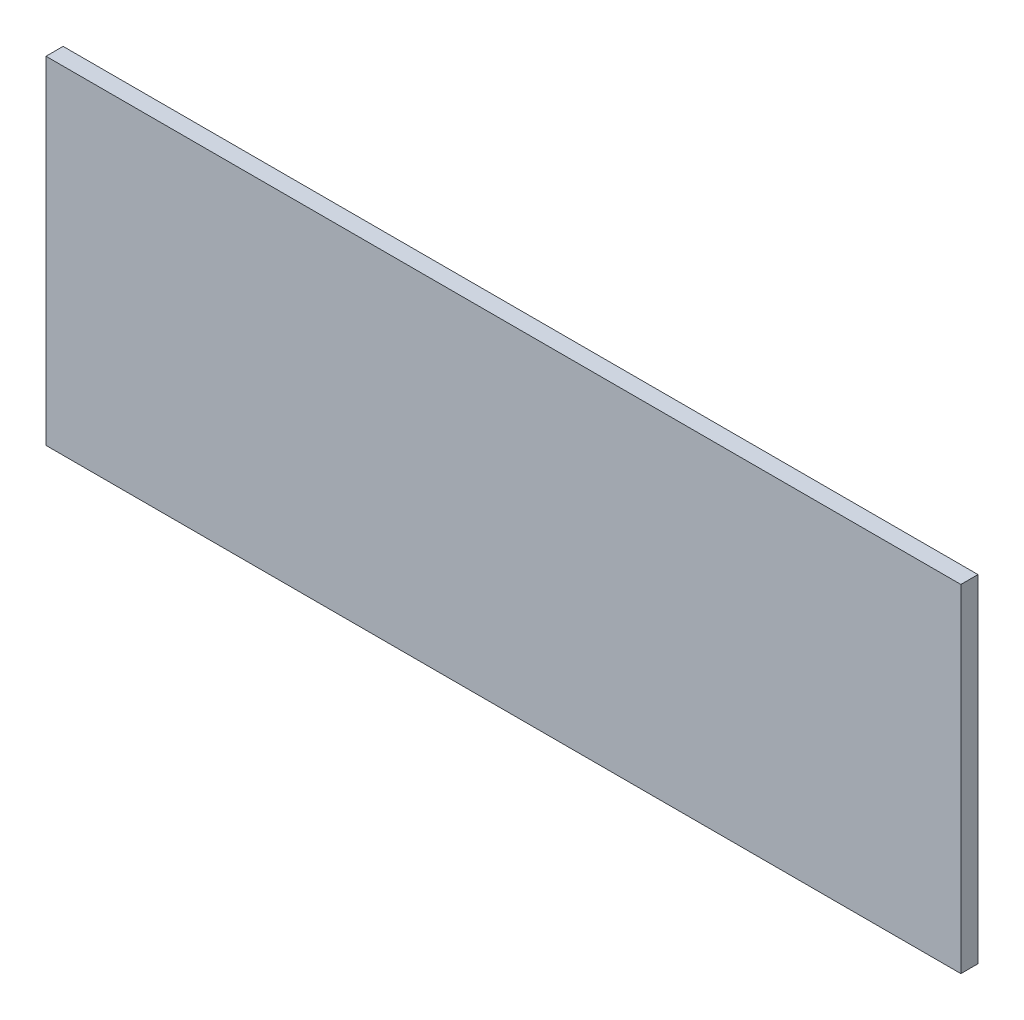
ISO-10303-21;
HEADER;
FILE_DESCRIPTION(('STEP AP214'),'2;1');
FILE_NAME('part.step','',(''),(''),'','','');
FILE_SCHEMA(('AUTOMOTIVE_DESIGN { 1 0 10303 214 1 1 1 1 }'));
ENDSEC;
DATA;
#1=APPLICATION_CONTEXT('core data for automotive mechanical design processes');
#2=APPLICATION_PROTOCOL_DEFINITION('international standard','automotive_design',2000,#1);
#3=PRODUCT_CONTEXT('',#1,'mechanical');
#4=PRODUCT('Part','Part','',(#3));
#5=PRODUCT_RELATED_PRODUCT_CATEGORY('part','',(#4));
#6=PRODUCT_DEFINITION_FORMATION('','',#4);
#7=PRODUCT_DEFINITION_CONTEXT('part definition',#1,'design');
#8=PRODUCT_DEFINITION('design','',#6,#7);
#9=PRODUCT_DEFINITION_SHAPE('','',#8);
#10=(LENGTH_UNIT() NAMED_UNIT(*) SI_UNIT(.MILLI.,.METRE.));
#11=(NAMED_UNIT(*) PLANE_ANGLE_UNIT() SI_UNIT($,.RADIAN.));
#12=(NAMED_UNIT(*) SI_UNIT($,.STERADIAN.) SOLID_ANGLE_UNIT());
#13=UNCERTAINTY_MEASURE_WITH_UNIT(LENGTH_MEASURE(1.E-05),#10,'distance_accuracy_value','');
#14=(GEOMETRIC_REPRESENTATION_CONTEXT(3) GLOBAL_UNCERTAINTY_ASSIGNED_CONTEXT((#13)) GLOBAL_UNIT_ASSIGNED_CONTEXT((#10,
#11,#12)) REPRESENTATION_CONTEXT('',''));
#15=CARTESIAN_POINT('',(0.,0.,0.));
#16=DIRECTION('',(0.,0.,1.));
#17=DIRECTION('',(1.,0.,0.));
#18=AXIS2_PLACEMENT_3D('',#15,#16,#17);
#19=CARTESIAN_POINT('',(96.5670013427734,66.3369979858398,0.));
#20=DIRECTION('',(0.,1.,0.));
#21=DIRECTION('',(1.,0.,0.));
#22=AXIS2_PLACEMENT_3D('',#19,#20,#21);
#23=PLANE('',#22);
#24=DIRECTION('',(1.,0.,0.));
#25=VECTOR('',#24,1.);
#26=CARTESIAN_POINT('',(96.5670013427734,66.3369979858398,0.03556));
#27=LINE('',#26,#25);
#28=CARTESIAN_POINT('',(96.5670013427734,66.3369979858398,0.03556));
#29=VERTEX_POINT('',#28);
#30=CARTESIAN_POINT('',(98.4670028686523,66.3369979858398,0.03556));
#31=VERTEX_POINT('',#30);
#32=EDGE_CURVE('E11',#29,#31,#27,.T.);
#33=ORIENTED_EDGE('',*,*,#32,.F.);
#34=DIRECTION('',(0.,0.,1.));
#35=VECTOR('',#34,1.);
#36=CARTESIAN_POINT('',(96.5670013427734,66.3369979858398,0.));
#37=LINE('',#36,#35);
#38=CARTESIAN_POINT('',(96.5670013427734,66.3369979858398,0.));
#39=VERTEX_POINT('',#38);
#40=EDGE_CURVE('E24',#39,#29,#37,.T.);
#41=ORIENTED_EDGE('',*,*,#40,.F.);
#42=DIRECTION('',(1.,0.,0.));
#43=VECTOR('',#42,1.);
#44=CARTESIAN_POINT('',(96.5670013427734,66.3369979858398,0.));
#45=LINE('',#44,#43);
#46=CARTESIAN_POINT('',(98.4670028686523,66.3369979858398,0.));
#47=VERTEX_POINT('',#46);
#48=EDGE_CURVE('E75',#39,#47,#45,.T.);
#49=ORIENTED_EDGE('',*,*,#48,.T.);
#50=DIRECTION('',(0.,0.,1.));
#51=VECTOR('',#50,1.);
#52=CARTESIAN_POINT('',(98.4670028686523,66.3369979858398,0.));
#53=LINE('',#52,#51);
#54=EDGE_CURVE('E37',#47,#31,#53,.T.);
#55=ORIENTED_EDGE('',*,*,#54,.T.);
#56=EDGE_LOOP('',(#33,#41,#49,#55));
#57=FACE_BOUND('',#56,.T.);
#58=ADVANCED_FACE('F17',(#57),#23,.F.);
#59=CARTESIAN_POINT('',(98.4670028686523,66.3369979858398,0.));
#60=DIRECTION('',(-1.,0.,0.));
#61=DIRECTION('',(0.,1.,0.));
#62=AXIS2_PLACEMENT_3D('',#59,#60,#61);
#63=PLANE('',#62);
#64=DIRECTION('',(0.,1.,0.));
#65=VECTOR('',#64,1.);
#66=CARTESIAN_POINT('',(98.4670028686523,66.3369979858398,0.03556));
#67=LINE('',#66,#65);
#68=CARTESIAN_POINT('',(98.4670028686523,67.0370025634766,0.03556));
#69=VERTEX_POINT('',#68);
#70=EDGE_CURVE('E83',#31,#69,#67,.T.);
#71=ORIENTED_EDGE('',*,*,#70,.F.);
#72=ORIENTED_EDGE('',*,*,#54,.F.);
#73=DIRECTION('',(0.,1.,0.));
#74=VECTOR('',#73,1.);
#75=CARTESIAN_POINT('',(98.4670028686523,66.3369979858398,0.));
#76=LINE('',#75,#74);
#77=CARTESIAN_POINT('',(98.4670028686523,67.0370025634766,0.));
#78=VERTEX_POINT('',#77);
#79=EDGE_CURVE('E81',#47,#78,#76,.T.);
#80=ORIENTED_EDGE('',*,*,#79,.T.);
#81=DIRECTION('',(0.,0.,1.));
#82=VECTOR('',#81,1.);
#83=CARTESIAN_POINT('',(98.4670028686523,67.0370025634766,0.));
#84=LINE('',#83,#82);
#85=EDGE_CURVE('E67',#78,#69,#84,.T.);
#86=ORIENTED_EDGE('',*,*,#85,.T.);
#87=EDGE_LOOP('',(#71,#72,#80,#86));
#88=FACE_BOUND('',#87,.T.);
#89=ADVANCED_FACE('F89',(#88),#63,.F.);
#90=CARTESIAN_POINT('',(98.4670028686523,67.0370025634766,0.));
#91=DIRECTION('',(0.,-1.,0.));
#92=DIRECTION('',(-1.,0.,0.));
#93=AXIS2_PLACEMENT_3D('',#90,#91,#92);
#94=PLANE('',#93);
#95=DIRECTION('',(-1.,0.,0.));
#96=VECTOR('',#95,1.);
#97=CARTESIAN_POINT('',(98.4670028686523,67.0370025634766,0.03556));
#98=LINE('',#97,#96);
#99=CARTESIAN_POINT('',(96.5670013427734,67.0370025634766,0.03556));
#100=VERTEX_POINT('',#99);
#101=EDGE_CURVE('E71',#69,#100,#98,.T.);
#102=ORIENTED_EDGE('',*,*,#101,.F.);
#103=ORIENTED_EDGE('',*,*,#85,.F.);
#104=DIRECTION('',(-1.,0.,0.));
#105=VECTOR('',#104,1.);
#106=CARTESIAN_POINT('',(98.4670028686523,67.0370025634766,0.));
#107=LINE('',#106,#105);
#108=CARTESIAN_POINT('',(96.5670013427734,67.0370025634766,0.));
#109=VERTEX_POINT('',#108);
#110=EDGE_CURVE('E63',#78,#109,#107,.T.);
#111=ORIENTED_EDGE('',*,*,#110,.T.);
#112=DIRECTION('',(0.,0.,1.));
#113=VECTOR('',#112,1.);
#114=CARTESIAN_POINT('',(96.5670013427734,67.0370025634766,0.));
#115=LINE('',#114,#113);
#116=EDGE_CURVE('E53',#109,#100,#115,.T.);
#117=ORIENTED_EDGE('',*,*,#116,.T.);
#118=EDGE_LOOP('',(#102,#103,#111,#117));
#119=FACE_BOUND('',#118,.T.);
#120=ADVANCED_FACE('F66',(#119),#94,.F.);
#121=CARTESIAN_POINT('',(96.5670013427734,67.0370025634766,0.));
#122=DIRECTION('',(1.,0.,0.));
#123=DIRECTION('',(0.,-1.,0.));
#124=AXIS2_PLACEMENT_3D('',#121,#122,#123);
#125=PLANE('',#124);
#126=DIRECTION('',(0.,-1.,0.));
#127=VECTOR('',#126,1.);
#128=CARTESIAN_POINT('',(96.5670013427734,67.0370025634766,0.03556));
#129=LINE('',#128,#127);
#130=EDGE_CURVE('E59',#100,#29,#129,.T.);
#131=ORIENTED_EDGE('',*,*,#130,.F.);
#132=ORIENTED_EDGE('',*,*,#116,.F.);
#133=DIRECTION('',(0.,-1.,0.));
#134=VECTOR('',#133,1.);
#135=CARTESIAN_POINT('',(96.5670013427734,67.0370025634766,0.));
#136=LINE('',#135,#134);
#137=EDGE_CURVE('E57',#109,#39,#136,.T.);
#138=ORIENTED_EDGE('',*,*,#137,.T.);
#139=ORIENTED_EDGE('',*,*,#40,.T.);
#140=EDGE_LOOP('',(#131,#132,#138,#139));
#141=FACE_BOUND('',#140,.T.);
#142=ADVANCED_FACE('F55',(#141),#125,.F.);
#143=CARTESIAN_POINT('',(96.5670013427734,66.3369979858398,0.));
#144=DIRECTION('',(0.,0.,-1.));
#145=DIRECTION('',(-1.,0.,0.));
#146=AXIS2_PLACEMENT_3D('',#143,#144,#145);
#147=PLANE('',#146);
#148=ORIENTED_EDGE('',*,*,#137,.F.);
#149=ORIENTED_EDGE('',*,*,#110,.F.);
#150=ORIENTED_EDGE('',*,*,#79,.F.);
#151=ORIENTED_EDGE('',*,*,#48,.F.);
#152=EDGE_LOOP('',(#148,#149,#150,#151));
#153=FACE_BOUND('',#152,.T.);
#154=ADVANCED_FACE('F74',(#153),#147,.T.);
#155=CARTESIAN_POINT('',(96.5670013427734,66.3369979858398,0.03556));
#156=DIRECTION('',(0.,0.,-1.));
#157=DIRECTION('',(-1.,0.,0.));
#158=AXIS2_PLACEMENT_3D('',#155,#156,#157);
#159=PLANE('',#158);
#160=ORIENTED_EDGE('',*,*,#32,.T.);
#161=ORIENTED_EDGE('',*,*,#70,.T.);
#162=ORIENTED_EDGE('',*,*,#101,.T.);
#163=ORIENTED_EDGE('',*,*,#130,.T.);
#164=EDGE_LOOP('',(#160,#161,#162,#163));
#165=FACE_BOUND('',#164,.T.);
#166=ADVANCED_FACE('F91',(#165),#159,.F.);
#167=CLOSED_SHELL('',(#58,#89,#120,#142,#154,#166));
#168=MANIFOLD_SOLID_BREP('B1',#167);
#169=ADVANCED_BREP_SHAPE_REPRESENTATION('',(#18,#168),#14);
#170=SHAPE_DEFINITION_REPRESENTATION(#9,#169);
ENDSEC;
END-ISO-10303-21;
